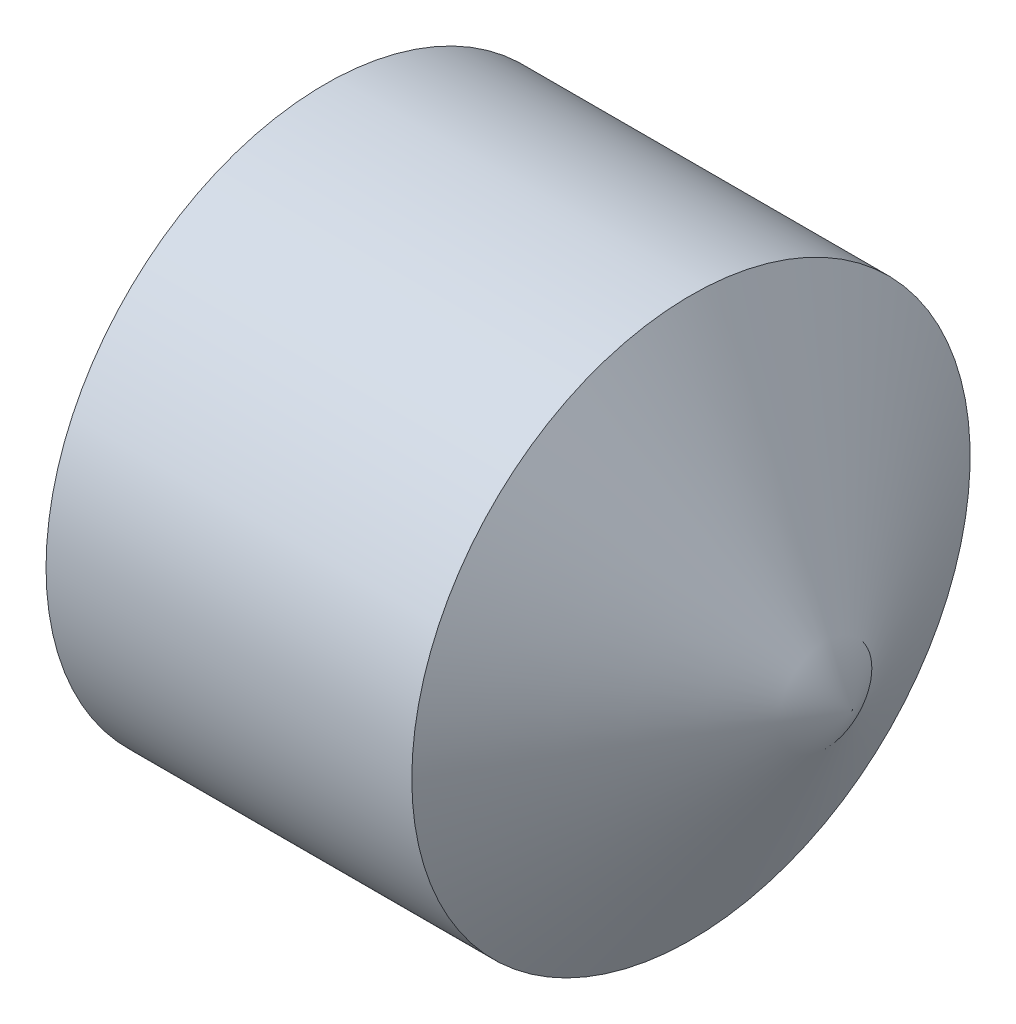
ISO-10303-21;
HEADER;
FILE_DESCRIPTION(('STEP AP214'),'2;1');
FILE_NAME('part.step','',(''),(''),'','','');
FILE_SCHEMA(('AUTOMOTIVE_DESIGN { 1 0 10303 214 1 1 1 1 }'));
ENDSEC;
DATA;
#1=APPLICATION_CONTEXT('core data for automotive mechanical design processes');
#2=APPLICATION_PROTOCOL_DEFINITION('international standard','automotive_design',2000,#1);
#3=PRODUCT_CONTEXT('',#1,'mechanical');
#4=PRODUCT('Part','Part','',(#3));
#5=PRODUCT_RELATED_PRODUCT_CATEGORY('part','',(#4));
#6=PRODUCT_DEFINITION_FORMATION('','',#4);
#7=PRODUCT_DEFINITION_CONTEXT('part definition',#1,'design');
#8=PRODUCT_DEFINITION('design','',#6,#7);
#9=PRODUCT_DEFINITION_SHAPE('','',#8);
#10=(LENGTH_UNIT() NAMED_UNIT(*) SI_UNIT(.MILLI.,.METRE.));
#11=(NAMED_UNIT(*) PLANE_ANGLE_UNIT() SI_UNIT($,.RADIAN.));
#12=(NAMED_UNIT(*) SI_UNIT($,.STERADIAN.) SOLID_ANGLE_UNIT());
#13=UNCERTAINTY_MEASURE_WITH_UNIT(LENGTH_MEASURE(1.E-05),#10,'distance_accuracy_value','');
#14=(GEOMETRIC_REPRESENTATION_CONTEXT(3) GLOBAL_UNCERTAINTY_ASSIGNED_CONTEXT((#13)) GLOBAL_UNIT_ASSIGNED_CONTEXT((#10,
#11,#12)) REPRESENTATION_CONTEXT('',''));
#15=CARTESIAN_POINT('',(0.,0.,0.));
#16=DIRECTION('',(0.,0.,1.));
#17=DIRECTION('',(1.,0.,0.));
#18=AXIS2_PLACEMENT_3D('',#15,#16,#17);
#19=CARTESIAN_POINT('',(1.5,-1.,1.154700538));
#20=DIRECTION('',(1.,0.,0.));
#21=DIRECTION('',(0.,0.,-1.));
#22=AXIS2_PLACEMENT_3D('',#19,#20,#21);
#23=PLANE('',#22);
#24=DIRECTION('',(0.,0.,-1.));
#25=VECTOR('',#24,1.);
#26=CARTESIAN_POINT('',(1.5,1.,0.));
#27=LINE('',#26,#25);
#28=CARTESIAN_POINT('',(1.5,1.,0.577350269));
#29=VERTEX_POINT('',#28);
#30=CARTESIAN_POINT('',(1.5,1.,-0.577350269));
#31=VERTEX_POINT('',#30);
#32=EDGE_CURVE('E105',#29,#31,#27,.T.);
#33=ORIENTED_EDGE('',*,*,#32,.T.);
#34=DIRECTION('',(0.,-0.866025403855548,-0.499999999876835));
#35=VECTOR('',#34,1.);
#36=CARTESIAN_POINT('',(1.5,0.5,-0.8660254035));
#37=LINE('',#36,#35);
#38=CARTESIAN_POINT('',(1.5,-5.59017025378306E-10,-1.15470053767725));
#39=VERTEX_POINT('',#38);
#40=EDGE_CURVE('E97',#31,#39,#37,.T.);
#41=ORIENTED_EDGE('',*,*,#40,.T.);
#42=DIRECTION('',(0.,0.866025403855548,-0.499999999876835));
#43=VECTOR('',#42,1.);
#44=CARTESIAN_POINT('',(1.5,-0.5,-0.8660254035));
#45=LINE('',#44,#43);
#46=CARTESIAN_POINT('',(1.5,-1.,-0.577350269));
#47=VERTEX_POINT('',#46);
#48=EDGE_CURVE('E104',#47,#39,#45,.T.);
#49=ORIENTED_EDGE('',*,*,#48,.F.);
#50=DIRECTION('',(0.,0.,-1.));
#51=VECTOR('',#50,1.);
#52=CARTESIAN_POINT('',(1.5,-1.,0.));
#53=LINE('',#52,#51);
#54=CARTESIAN_POINT('',(1.5,-1.,0.577350269));
#55=VERTEX_POINT('',#54);
#56=EDGE_CURVE('E108',#55,#47,#53,.T.);
#57=ORIENTED_EDGE('',*,*,#56,.F.);
#58=DIRECTION('',(0.,0.866025403855548,0.499999999876835));
#59=VECTOR('',#58,1.);
#60=CARTESIAN_POINT('',(1.5,-0.5,0.8660254035));
#61=LINE('',#60,#59);
#62=CARTESIAN_POINT('',(1.5,-5.59017025378306E-10,1.15470053767725));
#63=VERTEX_POINT('',#62);
#64=EDGE_CURVE('E81',#55,#63,#61,.T.);
#65=ORIENTED_EDGE('',*,*,#64,.T.);
#66=DIRECTION('',(0.,-0.866025403855548,0.499999999876835));
#67=VECTOR('',#66,1.);
#68=CARTESIAN_POINT('',(1.5,0.5,0.8660254035));
#69=LINE('',#68,#67);
#70=EDGE_CURVE('E78',#29,#63,#69,.T.);
#71=ORIENTED_EDGE('',*,*,#70,.F.);
#72=EDGE_LOOP('',(#33,#41,#49,#57,#65,#71));
#73=FACE_BOUND('',#72,.T.);
#74=ADVANCED_FACE('F17',(#73),#23,.F.);
#75=CARTESIAN_POINT('',(0.,1.,-0.577350269));
#76=DIRECTION('',(0.,1.,0.));
#77=DIRECTION('',(0.,0.,1.));
#78=AXIS2_PLACEMENT_3D('',#75,#76,#77);
#79=PLANE('',#78);
#80=DIRECTION('',(1.,0.,0.));
#81=VECTOR('',#80,1.);
#82=CARTESIAN_POINT('',(0.75,1.,-0.577350269));
#83=LINE('',#82,#81);
#84=CARTESIAN_POINT('',(0.,0.999999999321684,-0.577350268653938));
#85=VERTEX_POINT('',#84);
#86=EDGE_CURVE('E101',#85,#31,#83,.T.);
#87=ORIENTED_EDGE('',*,*,#86,.T.);
#88=ORIENTED_EDGE('',*,*,#32,.F.);
#89=DIRECTION('',(1.,0.,0.));
#90=VECTOR('',#89,1.);
#91=CARTESIAN_POINT('',(0.75,1.,0.577350269));
#92=LINE('',#91,#90);
#93=CARTESIAN_POINT('',(0.,0.999999999321684,0.577350268653939));
#94=VERTEX_POINT('',#93);
#95=EDGE_CURVE('E66',#94,#29,#92,.T.);
#96=ORIENTED_EDGE('',*,*,#95,.F.);
#97=DIRECTION('',(0.,0.,1.));
#98=VECTOR('',#97,1.);
#99=CARTESIAN_POINT('',(0.,0.99999999885632,0.));
#100=LINE('',#99,#98);
#101=EDGE_CURVE('E94',#85,#94,#100,.T.);
#102=ORIENTED_EDGE('',*,*,#101,.F.);
#103=EDGE_LOOP('',(#87,#88,#96,#102));
#104=FACE_BOUND('',#103,.T.);
#105=ADVANCED_FACE('F150',(#104),#79,.F.);
#106=CARTESIAN_POINT('',(0.,0.,1.154700538));
#107=DIRECTION('',(0.,-0.499999999876835,-0.866025403855548));
#108=DIRECTION('',(0.,0.866025403855548,-0.499999999876835));
#109=AXIS2_PLACEMENT_3D('',#106,#107,#108);
#110=PLANE('',#109);
#111=ORIENTED_EDGE('',*,*,#70,.T.);
#112=DIRECTION('',(-1.,0.,0.));
#113=VECTOR('',#112,1.);
#114=CARTESIAN_POINT('',(0.75,0.,1.154700538));
#115=LINE('',#114,#113);
#116=CARTESIAN_POINT('',(0.,-6.99921891278432E-11,1.15470053755549));
#117=VERTEX_POINT('',#116);
#118=EDGE_CURVE('E72',#63,#117,#115,.T.);
#119=ORIENTED_EDGE('',*,*,#118,.T.);
#120=DIRECTION('',(0.,-0.866025403729164,0.500000000095738));
#121=VECTOR('',#120,1.);
#122=CARTESIAN_POINT('',(0.,0.99999999885632,0.577350268676721));
#123=LINE('',#122,#121);
#124=EDGE_CURVE('E21',#94,#117,#123,.T.);
#125=ORIENTED_EDGE('',*,*,#124,.F.);
#126=ORIENTED_EDGE('',*,*,#95,.T.);
#127=EDGE_LOOP('',(#111,#119,#125,#126));
#128=FACE_BOUND('',#127,.T.);
#129=ADVANCED_FACE('F74',(#128),#110,.T.);
#130=CARTESIAN_POINT('',(0.,0.,1.154700538));
#131=DIRECTION('',(0.,-0.499999999876835,0.866025403855548));
#132=DIRECTION('',(0.,-0.866025403855548,-0.499999999876835));
#133=AXIS2_PLACEMENT_3D('',#130,#131,#132);
#134=PLANE('',#133);
#135=ORIENTED_EDGE('',*,*,#118,.F.);
#136=ORIENTED_EDGE('',*,*,#64,.F.);
#137=DIRECTION('',(1.,0.,0.));
#138=VECTOR('',#137,1.);
#139=CARTESIAN_POINT('',(0.75,-1.,0.577350269));
#140=LINE('',#139,#138);
#141=CARTESIAN_POINT('',(0.,-0.999999999321684,0.577350268653938));
#142=VERTEX_POINT('',#141);
#143=EDGE_CURVE('E80',#142,#55,#140,.T.);
#144=ORIENTED_EDGE('',*,*,#143,.F.);
#145=DIRECTION('',(0.,-0.866025403729164,-0.500000000095738));
#146=VECTOR('',#145,1.);
#147=CARTESIAN_POINT('',(0.,0.,1.15470053735344));
#148=LINE('',#147,#146);
#149=EDGE_CURVE('E84',#117,#142,#148,.T.);
#150=ORIENTED_EDGE('',*,*,#149,.F.);
#151=EDGE_LOOP('',(#135,#136,#144,#150));
#152=FACE_BOUND('',#151,.T.);
#153=ADVANCED_FACE('F85',(#152),#134,.F.);
#154=CARTESIAN_POINT('',(0.,-1.,-0.577350269));
#155=DIRECTION('',(0.,1.,0.));
#156=DIRECTION('',(0.,0.,1.));
#157=AXIS2_PLACEMENT_3D('',#154,#155,#156);
#158=PLANE('',#157);
#159=ORIENTED_EDGE('',*,*,#56,.T.);
#160=DIRECTION('',(1.,0.,0.));
#161=VECTOR('',#160,1.);
#162=CARTESIAN_POINT('',(0.75,-1.,-0.577350269));
#163=LINE('',#162,#161);
#164=CARTESIAN_POINT('',(0.,-0.999999999321684,-0.577350268653938));
#165=VERTEX_POINT('',#164);
#166=EDGE_CURVE('E117',#165,#47,#163,.T.);
#167=ORIENTED_EDGE('',*,*,#166,.F.);
#168=DIRECTION('',(0.,0.,-1.));
#169=VECTOR('',#168,1.);
#170=CARTESIAN_POINT('',(0.,-0.99999999885632,0.));
#171=LINE('',#170,#169);
#172=EDGE_CURVE('E90',#142,#165,#171,.T.);
#173=ORIENTED_EDGE('',*,*,#172,.F.);
#174=ORIENTED_EDGE('',*,*,#143,.T.);
#175=EDGE_LOOP('',(#159,#167,#173,#174));
#176=FACE_BOUND('',#175,.T.);
#177=ADVANCED_FACE('F158',(#176),#158,.T.);
#178=CARTESIAN_POINT('',(0.,0.,-1.154700538));
#179=DIRECTION('',(0.,0.499999999876835,0.866025403855548));
#180=DIRECTION('',(0.,-0.866025403855548,0.499999999876835));
#181=AXIS2_PLACEMENT_3D('',#178,#179,#180);
#182=PLANE('',#181);
#183=ORIENTED_EDGE('',*,*,#48,.T.);
#184=DIRECTION('',(-1.,0.,0.));
#185=VECTOR('',#184,1.);
#186=CARTESIAN_POINT('',(0.75,0.,-1.154700538));
#187=LINE('',#186,#185);
#188=CARTESIAN_POINT('',(0.,6.99922433379518E-11,-1.15470053755549));
#189=VERTEX_POINT('',#188);
#190=EDGE_CURVE('E95',#39,#189,#187,.T.);
#191=ORIENTED_EDGE('',*,*,#190,.T.);
#192=DIRECTION('',(0.,0.866025403729164,-0.500000000095738));
#193=VECTOR('',#192,1.);
#194=CARTESIAN_POINT('',(0.,-0.99999999885632,-0.577350268676719));
#195=LINE('',#194,#193);
#196=EDGE_CURVE('E114',#165,#189,#195,.T.);
#197=ORIENTED_EDGE('',*,*,#196,.F.);
#198=ORIENTED_EDGE('',*,*,#166,.T.);
#199=EDGE_LOOP('',(#183,#191,#197,#198));
#200=FACE_BOUND('',#199,.T.);
#201=ADVANCED_FACE('F161',(#200),#182,.T.);
#202=CARTESIAN_POINT('',(0.,0.,-1.154700538));
#203=DIRECTION('',(0.,0.499999999876835,-0.866025403855548));
#204=DIRECTION('',(0.,0.866025403855548,0.499999999876835));
#205=AXIS2_PLACEMENT_3D('',#202,#203,#204);
#206=PLANE('',#205);
#207=ORIENTED_EDGE('',*,*,#190,.F.);
#208=ORIENTED_EDGE('',*,*,#40,.F.);
#209=ORIENTED_EDGE('',*,*,#86,.F.);
#210=DIRECTION('',(0.,0.866025403729164,0.500000000095738));
#211=VECTOR('',#210,1.);
#212=CARTESIAN_POINT('',(0.,0.,-1.15470053735344));
#213=LINE('',#212,#211);
#214=EDGE_CURVE('E112',#189,#85,#213,.T.);
#215=ORIENTED_EDGE('',*,*,#214,.F.);
#216=EDGE_LOOP('',(#207,#208,#209,#215));
#217=FACE_BOUND('',#216,.T.);
#218=ADVANCED_FACE('F164',(#217),#206,.F.);
#219=CARTESIAN_POINT('',(0.,-1.62932,-1.62932));
#220=DIRECTION('',(-1.,0.,0.));
#221=DIRECTION('',(0.,0.,1.));
#222=AXIS2_PLACEMENT_3D('',#219,#220,#221);
#223=PLANE('',#222);
#224=ORIENTED_EDGE('',*,*,#196,.T.);
#225=ORIENTED_EDGE('',*,*,#214,.T.);
#226=ORIENTED_EDGE('',*,*,#101,.T.);
#227=ORIENTED_EDGE('',*,*,#124,.T.);
#228=ORIENTED_EDGE('',*,*,#149,.T.);
#229=ORIENTED_EDGE('',*,*,#172,.T.);
#230=EDGE_LOOP('',(#224,#225,#226,#227,#228,#229));
#231=FACE_BOUND('',#230,.T.);
#232=CARTESIAN_POINT('',(0.,0.,0.));
#233=DIRECTION('',(1.,0.,0.));
#234=DIRECTION('',(0.,0.,-1.));
#235=AXIS2_PLACEMENT_3D('',#232,#233,#234);
#236=CIRCLE('',#235,1.61);
#237=CARTESIAN_POINT('',(0.,0.,-1.61));
#238=VERTEX_POINT('',#237);
#239=EDGE_CURVE('E109',#238,#238,#236,.F.);
#240=ORIENTED_EDGE('',*,*,#239,.T.);
#241=EDGE_LOOP('',(#240));
#242=FACE_BOUND('',#241,.T.);
#243=ADVANCED_FACE('F19',(#231,#242),#223,.T.);
#244=CARTESIAN_POINT('',(0.,0.,0.));
#245=DIRECTION('',(1.,0.,0.));
#246=DIRECTION('',(0.,0.,-1.));
#247=AXIS2_PLACEMENT_3D('',#244,#245,#246);
#248=CONICAL_SURFACE('',#247,1.61,1.04719755116574);
#249=CARTESIAN_POINT('',(0.225166605,0.,0.));
#250=DIRECTION('',(-1.,0.,0.));
#251=DIRECTION('',(0.,0.,1.));
#252=AXIS2_PLACEMENT_3D('',#249,#250,#251);
#253=CIRCLE('',#252,2.);
#254=CARTESIAN_POINT('',(0.225166605,0.,2.));
#255=VERTEX_POINT('',#254);
#256=EDGE_CURVE('E27',#255,#255,#253,.T.);
#257=ORIENTED_EDGE('',*,*,#256,.T.);
#258=EDGE_LOOP('',(#257));
#259=FACE_BOUND('',#258,.T.);
#260=ORIENTED_EDGE('',*,*,#239,.F.);
#261=EDGE_LOOP('',(#260));
#262=FACE_BOUND('',#261,.T.);
#263=ADVANCED_FACE('F130',(#259,#262),#248,.T.);
#264=CARTESIAN_POINT('',(2.845299462,0.,0.));
#265=DIRECTION('',(-1.,0.,0.));
#266=DIRECTION('',(0.,0.,1.));
#267=AXIS2_PLACEMENT_3D('',#264,#265,#266);
#268=CYLINDRICAL_SURFACE('',#267,2.);
#269=ORIENTED_EDGE('',*,*,#256,.F.);
#270=EDGE_LOOP('',(#269));
#271=FACE_BOUND('',#270,.T.);
#272=CARTESIAN_POINT('',(2.84529946199996,0.,0.));
#273=DIRECTION('',(-1.,0.,0.));
#274=DIRECTION('',(0.,0.,1.));
#275=AXIS2_PLACEMENT_3D('',#272,#273,#274);
#276=CIRCLE('',#275,2.);
#277=CARTESIAN_POINT('',(2.845299462,0.,2.));
#278=VERTEX_POINT('',#277);
#279=EDGE_CURVE('E11',#278,#278,#276,.T.);
#280=ORIENTED_EDGE('',*,*,#279,.T.);
#281=EDGE_LOOP('',(#280));
#282=FACE_BOUND('',#281,.T.);
#283=ADVANCED_FACE('F133',(#271,#282),#268,.T.);
#284=CARTESIAN_POINT('',(4.,0.,0.));
#285=DIRECTION('',(-1.,0.,0.));
#286=DIRECTION('',(0.,0.,1.));
#287=AXIS2_PLACEMENT_3D('',#284,#285,#286);
#288=CONICAL_SURFACE('',#287,0.,1.04719755133882);
#289=CARTESIAN_POINT('',(4.,0.,0.));
#290=VERTEX_POINT('',#289);
#291=VERTEX_LOOP('',#290);
#292=FACE_BOUND('',#291,.T.);
#293=ORIENTED_EDGE('',*,*,#279,.F.);
#294=EDGE_LOOP('',(#293));
#295=FACE_BOUND('',#294,.T.);
#296=ADVANCED_FACE('F136',(#292,#295),#288,.T.);
#297=CLOSED_SHELL('',(#74,#105,#129,#153,#177,#201,#218,#243,#263,#283,#296));
#298=MANIFOLD_SOLID_BREP('B1',#297);
#299=ADVANCED_BREP_SHAPE_REPRESENTATION('',(#18,#298),#14);
#300=SHAPE_DEFINITION_REPRESENTATION(#9,#299);
ENDSEC;
END-ISO-10303-21;
